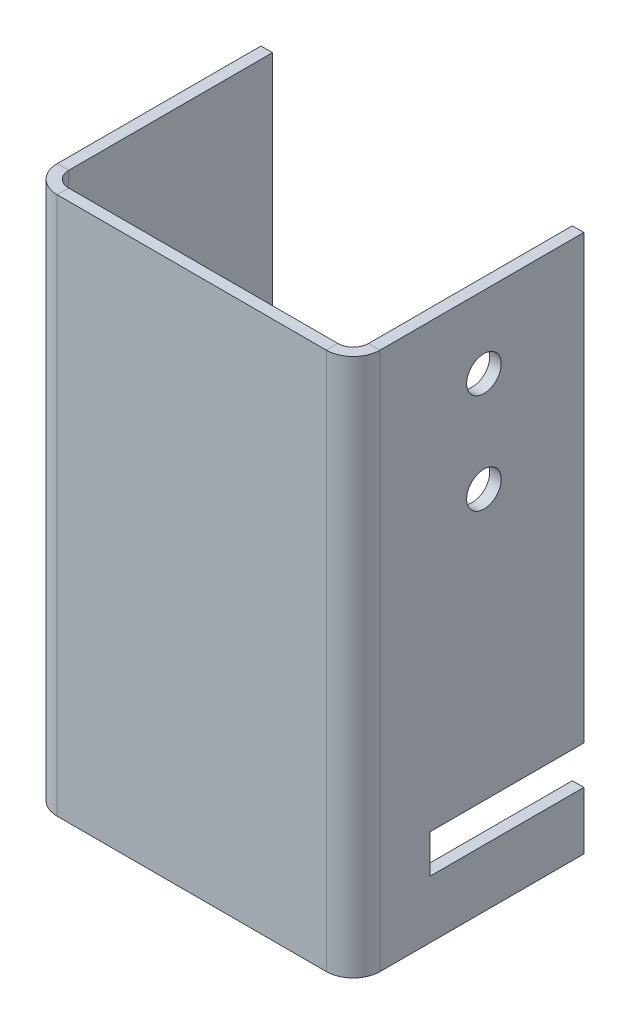
ISO-10303-21;
HEADER;
FILE_DESCRIPTION(('STEP AP214'),'2;1');
FILE_NAME('part.step','',(''),(''),'','','');
FILE_SCHEMA(('AUTOMOTIVE_DESIGN { 1 0 10303 214 1 1 1 1 }'));
ENDSEC;
DATA;
#1=APPLICATION_CONTEXT('core data for automotive mechanical design processes');
#2=APPLICATION_PROTOCOL_DEFINITION('international standard','automotive_design',2000,#1);
#3=PRODUCT_CONTEXT('',#1,'mechanical');
#4=PRODUCT('Part','Part','',(#3));
#5=PRODUCT_RELATED_PRODUCT_CATEGORY('part','',(#4));
#6=PRODUCT_DEFINITION_FORMATION('','',#4);
#7=PRODUCT_DEFINITION_CONTEXT('part definition',#1,'design');
#8=PRODUCT_DEFINITION('design','',#6,#7);
#9=PRODUCT_DEFINITION_SHAPE('','',#8);
#10=(LENGTH_UNIT() NAMED_UNIT(*) SI_UNIT(.MILLI.,.METRE.));
#11=(NAMED_UNIT(*) PLANE_ANGLE_UNIT() SI_UNIT($,.RADIAN.));
#12=(NAMED_UNIT(*) SI_UNIT($,.STERADIAN.) SOLID_ANGLE_UNIT());
#13=UNCERTAINTY_MEASURE_WITH_UNIT(LENGTH_MEASURE(1.E-05),#10,'distance_accuracy_value','');
#14=(GEOMETRIC_REPRESENTATION_CONTEXT(3) GLOBAL_UNCERTAINTY_ASSIGNED_CONTEXT((#13)) GLOBAL_UNIT_ASSIGNED_CONTEXT((#10,
#11,#12)) REPRESENTATION_CONTEXT('',''));
#15=CARTESIAN_POINT('',(0.,0.,0.));
#16=DIRECTION('',(0.,0.,1.));
#17=DIRECTION('',(1.,0.,0.));
#18=AXIS2_PLACEMENT_3D('',#15,#16,#17);
#19=CARTESIAN_POINT('',(42.,70.,-30.));
#20=DIRECTION('',(0.,0.,-1.));
#21=DIRECTION('',(0.,-1.,0.));
#22=AXIS2_PLACEMENT_3D('',#19,#20,#21);
#23=PLANE('',#22);
#24=DIRECTION('',(1.,0.,0.));
#25=VECTOR('',#24,1.);
#26=CARTESIAN_POINT('',(-0.001000000000001,12.5,-30.));
#27=LINE('',#26,#25);
#28=CARTESIAN_POINT('',(40.5,12.5,-30.));
#29=VERTEX_POINT('',#28);
#30=CARTESIAN_POINT('',(42.,12.5,-30.));
#31=VERTEX_POINT('',#30);
#32=EDGE_CURVE('E642',#29,#31,#27,.T.);
#33=ORIENTED_EDGE('',*,*,#32,.F.);
#34=DIRECTION('',(0.,1.,0.));
#35=VECTOR('',#34,1.);
#36=CARTESIAN_POINT('',(40.5,70.,-30.));
#37=LINE('',#36,#35);
#38=CARTESIAN_POINT('',(40.5,70.,-30.));
#39=VERTEX_POINT('',#38);
#40=EDGE_CURVE('E165',#39,#29,#37,.F.);
#41=ORIENTED_EDGE('',*,*,#40,.F.);
#42=DIRECTION('',(1.,0.,0.));
#43=VECTOR('',#42,1.);
#44=CARTESIAN_POINT('',(42.,70.,-30.));
#45=LINE('',#44,#43);
#46=CARTESIAN_POINT('',(42.,70.,-30.));
#47=VERTEX_POINT('',#46);
#48=EDGE_CURVE('E190',#39,#47,#45,.T.);
#49=ORIENTED_EDGE('',*,*,#48,.T.);
#50=DIRECTION('',(0.,-1.,0.));
#51=VECTOR('',#50,1.);
#52=CARTESIAN_POINT('',(42.,70.,-30.));
#53=LINE('',#52,#51);
#54=EDGE_CURVE('E270',#47,#31,#53,.T.);
#55=ORIENTED_EDGE('',*,*,#54,.T.);
#56=EDGE_LOOP('',(#33,#41,#49,#55));
#57=FACE_BOUND('',#56,.T.);
#58=ADVANCED_FACE('F37',(#57),#23,.T.);
#59=CARTESIAN_POINT('',(0.,0.,0.));
#60=DIRECTION('',(0.,1.,0.));
#61=DIRECTION('',(1.,0.,0.));
#62=AXIS2_PLACEMENT_3D('',#59,#60,#61);
#63=PLANE('',#62);
#64=DIRECTION('',(0.,0.,1.));
#65=VECTOR('',#64,1.);
#66=CARTESIAN_POINT('',(3.5,0.,0.));
#67=LINE('',#66,#65);
#68=CARTESIAN_POINT('',(3.5,0.,-1.5));
#69=VERTEX_POINT('',#68);
#70=CARTESIAN_POINT('',(3.5,0.,0.));
#71=VERTEX_POINT('',#70);
#72=EDGE_CURVE('E11',#69,#71,#67,.T.);
#73=ORIENTED_EDGE('',*,*,#72,.F.);
#74=DIRECTION('',(-1.,0.,0.));
#75=VECTOR('',#74,1.);
#76=CARTESIAN_POINT('',(0.,0.,-1.5));
#77=LINE('',#76,#75);
#78=CARTESIAN_POINT('',(38.5,0.,-1.5));
#79=VERTEX_POINT('',#78);
#80=EDGE_CURVE('E151',#69,#79,#77,.F.);
#81=ORIENTED_EDGE('',*,*,#80,.T.);
#82=DIRECTION('',(0.,0.,1.));
#83=VECTOR('',#82,1.);
#84=CARTESIAN_POINT('',(38.5,0.,0.));
#85=LINE('',#84,#83);
#86=CARTESIAN_POINT('',(38.5,0.,0.));
#87=VERTEX_POINT('',#86);
#88=EDGE_CURVE('E46',#79,#87,#85,.T.);
#89=ORIENTED_EDGE('',*,*,#88,.T.);
#90=DIRECTION('',(1.,0.,0.));
#91=VECTOR('',#90,1.);
#92=CARTESIAN_POINT('',(0.,0.,0.));
#93=LINE('',#92,#91);
#94=EDGE_CURVE('E276',#71,#87,#93,.T.);
#95=ORIENTED_EDGE('',*,*,#94,.F.);
#96=EDGE_LOOP('',(#73,#81,#89,#95));
#97=FACE_BOUND('',#96,.T.);
#98=ADVANCED_FACE('F324',(#97),#63,.F.);
#99=CARTESIAN_POINT('',(38.5,0.,-3.5));
#100=DIRECTION('',(0.,1.,0.));
#101=DIRECTION('',(0.,0.,1.));
#102=AXIS2_PLACEMENT_3D('',#99,#100,#101);
#103=PLANE('',#102);
#104=ORIENTED_EDGE('',*,*,#88,.F.);
#105=CARTESIAN_POINT('',(38.5,0.,-3.5));
#106=DIRECTION('',(0.,-1.,0.));
#107=DIRECTION('',(0.,0.,-1.));
#108=AXIS2_PLACEMENT_3D('',#105,#106,#107);
#109=CIRCLE('',#108,2.);
#110=CARTESIAN_POINT('',(40.5,0.,-3.5));
#111=VERTEX_POINT('',#110);
#112=EDGE_CURVE('E161',#79,#111,#109,.F.);
#113=ORIENTED_EDGE('',*,*,#112,.T.);
#114=DIRECTION('',(1.,0.,0.));
#115=VECTOR('',#114,1.);
#116=CARTESIAN_POINT('',(42.,0.,-3.5));
#117=LINE('',#116,#115);
#118=CARTESIAN_POINT('',(42.,0.,-3.5));
#119=VERTEX_POINT('',#118);
#120=EDGE_CURVE('E196',#111,#119,#117,.T.);
#121=ORIENTED_EDGE('',*,*,#120,.T.);
#122=CARTESIAN_POINT('',(38.5,0.,-3.5));
#123=DIRECTION('',(0.,-1.,0.));
#124=DIRECTION('',(0.,0.,-1.));
#125=AXIS2_PLACEMENT_3D('',#122,#123,#124);
#126=CIRCLE('',#125,3.5);
#127=EDGE_CURVE('E204',#87,#119,#126,.F.);
#128=ORIENTED_EDGE('',*,*,#127,.F.);
#129=EDGE_LOOP('',(#104,#113,#121,#128));
#130=FACE_BOUND('',#129,.T.);
#131=ADVANCED_FACE('F203',(#130),#103,.F.);
#132=CARTESIAN_POINT('',(42.,0.,0.));
#133=DIRECTION('',(0.,1.,0.));
#134=DIRECTION('',(0.,0.,-1.));
#135=AXIS2_PLACEMENT_3D('',#132,#133,#134);
#136=PLANE('',#135);
#137=ORIENTED_EDGE('',*,*,#120,.F.);
#138=DIRECTION('',(0.,0.,1.));
#139=VECTOR('',#138,1.);
#140=CARTESIAN_POINT('',(40.5,0.,0.));
#141=LINE('',#140,#139);
#142=CARTESIAN_POINT('',(40.5,0.,-30.));
#143=VERTEX_POINT('',#142);
#144=EDGE_CURVE('E157',#111,#143,#141,.F.);
#145=ORIENTED_EDGE('',*,*,#144,.T.);
#146=DIRECTION('',(1.,0.,0.));
#147=VECTOR('',#146,1.);
#148=CARTESIAN_POINT('',(42.,0.,-30.));
#149=LINE('',#148,#147);
#150=CARTESIAN_POINT('',(42.,0.,-30.));
#151=VERTEX_POINT('',#150);
#152=EDGE_CURVE('E193',#143,#151,#149,.T.);
#153=ORIENTED_EDGE('',*,*,#152,.T.);
#154=DIRECTION('',(0.,0.,-1.));
#155=VECTOR('',#154,1.);
#156=CARTESIAN_POINT('',(42.,0.,0.));
#157=LINE('',#156,#155);
#158=EDGE_CURVE('E223',#119,#151,#157,.T.);
#159=ORIENTED_EDGE('',*,*,#158,.F.);
#160=EDGE_LOOP('',(#137,#145,#153,#159));
#161=FACE_BOUND('',#160,.T.);
#162=ADVANCED_FACE('F224',(#161),#136,.F.);
#163=DIRECTION('',(1.,0.,0.));
#164=VECTOR('',#163,1.);
#165=CARTESIAN_POINT('',(-0.001000000000001,7.5,-30.));
#166=LINE('',#165,#164);
#167=CARTESIAN_POINT('',(40.5,7.50000000000001,-30.));
#168=VERTEX_POINT('',#167);
#169=CARTESIAN_POINT('',(42.,7.5,-30.));
#170=VERTEX_POINT('',#169);
#171=EDGE_CURVE('E53',#168,#170,#166,.T.);
#172=ORIENTED_EDGE('',*,*,#171,.T.);
#173=EDGE_CURVE('E228',#170,#151,#53,.T.);
#174=ORIENTED_EDGE('',*,*,#173,.T.);
#175=ORIENTED_EDGE('',*,*,#152,.F.);
#176=EDGE_CURVE('E168',#168,#143,#37,.F.);
#177=ORIENTED_EDGE('',*,*,#176,.F.);
#178=EDGE_LOOP('',(#172,#174,#175,#177));
#179=FACE_BOUND('',#178,.T.);
#180=ADVANCED_FACE('F265',(#179),#23,.T.);
#181=CARTESIAN_POINT('',(42.,70.,0.));
#182=DIRECTION('',(0.,1.,0.));
#183=DIRECTION('',(0.,0.,-1.));
#184=AXIS2_PLACEMENT_3D('',#181,#182,#183);
#185=PLANE('',#184);
#186=ORIENTED_EDGE('',*,*,#48,.F.);
#187=DIRECTION('',(0.,0.,1.));
#188=VECTOR('',#187,1.);
#189=CARTESIAN_POINT('',(40.5,70.,0.));
#190=LINE('',#189,#188);
#191=CARTESIAN_POINT('',(40.5,70.,-3.5));
#192=VERTEX_POINT('',#191);
#193=EDGE_CURVE('E162',#192,#39,#190,.F.);
#194=ORIENTED_EDGE('',*,*,#193,.F.);
#195=DIRECTION('',(1.,0.,0.));
#196=VECTOR('',#195,1.);
#197=CARTESIAN_POINT('',(42.,70.,-3.5));
#198=LINE('',#197,#196);
#199=CARTESIAN_POINT('',(42.,70.,-3.5));
#200=VERTEX_POINT('',#199);
#201=EDGE_CURVE('E187',#192,#200,#198,.T.);
#202=ORIENTED_EDGE('',*,*,#201,.T.);
#203=DIRECTION('',(0.,0.,-1.));
#204=VECTOR('',#203,1.);
#205=CARTESIAN_POINT('',(42.,70.,0.));
#206=LINE('',#205,#204);
#207=EDGE_CURVE('E236',#200,#47,#206,.T.);
#208=ORIENTED_EDGE('',*,*,#207,.T.);
#209=EDGE_LOOP('',(#186,#194,#202,#208));
#210=FACE_BOUND('',#209,.T.);
#211=ADVANCED_FACE('F315',(#210),#185,.T.);
#212=CARTESIAN_POINT('',(38.5,70.,-3.5));
#213=DIRECTION('',(0.,-1.,0.));
#214=DIRECTION('',(0.,0.,-1.));
#215=AXIS2_PLACEMENT_3D('',#212,#213,#214);
#216=PLANE('',#215);
#217=ORIENTED_EDGE('',*,*,#201,.F.);
#218=CARTESIAN_POINT('',(38.5,70.,-3.5));
#219=DIRECTION('',(0.,-1.,0.));
#220=DIRECTION('',(0.,0.,-1.));
#221=AXIS2_PLACEMENT_3D('',#218,#219,#220);
#222=CIRCLE('',#221,2.);
#223=CARTESIAN_POINT('',(38.5,70.,-1.5));
#224=VERTEX_POINT('',#223);
#225=EDGE_CURVE('E142',#192,#224,#222,.T.);
#226=ORIENTED_EDGE('',*,*,#225,.T.);
#227=DIRECTION('',(0.,0.,1.));
#228=VECTOR('',#227,1.);
#229=CARTESIAN_POINT('',(38.5,70.,0.));
#230=LINE('',#229,#228);
#231=CARTESIAN_POINT('',(38.5,70.,0.));
#232=VERTEX_POINT('',#231);
#233=EDGE_CURVE('E185',#224,#232,#230,.T.);
#234=ORIENTED_EDGE('',*,*,#233,.T.);
#235=CARTESIAN_POINT('',(38.5,70.,-3.5));
#236=DIRECTION('',(0.,1.,0.));
#237=DIRECTION('',(0.,0.,1.));
#238=AXIS2_PLACEMENT_3D('',#235,#236,#237);
#239=CIRCLE('',#238,3.5);
#240=EDGE_CURVE('E219',#200,#232,#239,.F.);
#241=ORIENTED_EDGE('',*,*,#240,.F.);
#242=EDGE_LOOP('',(#217,#226,#234,#241));
#243=FACE_BOUND('',#242,.T.);
#244=ADVANCED_FACE('F317',(#243),#216,.F.);
#245=CARTESIAN_POINT('',(0.,70.,0.));
#246=DIRECTION('',(0.,1.,0.));
#247=DIRECTION('',(1.,0.,0.));
#248=AXIS2_PLACEMENT_3D('',#245,#246,#247);
#249=PLANE('',#248);
#250=ORIENTED_EDGE('',*,*,#233,.F.);
#251=DIRECTION('',(-1.,0.,0.));
#252=VECTOR('',#251,1.);
#253=CARTESIAN_POINT('',(0.,70.,-1.5));
#254=LINE('',#253,#252);
#255=CARTESIAN_POINT('',(3.5,70.,-1.5));
#256=VERTEX_POINT('',#255);
#257=EDGE_CURVE('E146',#256,#224,#254,.F.);
#258=ORIENTED_EDGE('',*,*,#257,.F.);
#259=DIRECTION('',(0.,0.,1.));
#260=VECTOR('',#259,1.);
#261=CARTESIAN_POINT('',(3.5,70.,0.));
#262=LINE('',#261,#260);
#263=CARTESIAN_POINT('',(3.5,70.,0.));
#264=VERTEX_POINT('',#263);
#265=EDGE_CURVE('E182',#256,#264,#262,.T.);
#266=ORIENTED_EDGE('',*,*,#265,.T.);
#267=DIRECTION('',(1.,0.,0.));
#268=VECTOR('',#267,1.);
#269=CARTESIAN_POINT('',(0.,70.,0.));
#270=LINE('',#269,#268);
#271=EDGE_CURVE('E278',#264,#232,#270,.T.);
#272=ORIENTED_EDGE('',*,*,#271,.T.);
#273=EDGE_LOOP('',(#250,#258,#266,#272));
#274=FACE_BOUND('',#273,.T.);
#275=ADVANCED_FACE('F320',(#274),#249,.T.);
#276=CARTESIAN_POINT('',(3.5,70.,-3.5));
#277=DIRECTION('',(0.,-1.,0.));
#278=DIRECTION('',(0.,0.,-1.));
#279=AXIS2_PLACEMENT_3D('',#276,#277,#278);
#280=PLANE('',#279);
#281=ORIENTED_EDGE('',*,*,#265,.F.);
#282=CARTESIAN_POINT('',(3.5,70.,-3.5));
#283=DIRECTION('',(0.,-1.,0.));
#284=DIRECTION('',(0.,0.,-1.));
#285=AXIS2_PLACEMENT_3D('',#282,#283,#284);
#286=CIRCLE('',#285,2.);
#287=CARTESIAN_POINT('',(1.5,70.,-3.5));
#288=VERTEX_POINT('',#287);
#289=EDGE_CURVE('E141',#256,#288,#286,.T.);
#290=ORIENTED_EDGE('',*,*,#289,.T.);
#291=DIRECTION('',(-1.,0.,0.));
#292=VECTOR('',#291,1.);
#293=CARTESIAN_POINT('',(0.,70.,-3.5));
#294=LINE('',#293,#292);
#295=CARTESIAN_POINT('',(0.,70.,-3.5));
#296=VERTEX_POINT('',#295);
#297=EDGE_CURVE('E179',#288,#296,#294,.T.);
#298=ORIENTED_EDGE('',*,*,#297,.T.);
#299=CARTESIAN_POINT('',(3.5,70.,-3.5));
#300=DIRECTION('',(0.,1.,0.));
#301=DIRECTION('',(0.,0.,1.));
#302=AXIS2_PLACEMENT_3D('',#299,#300,#301);
#303=CIRCLE('',#302,3.5);
#304=EDGE_CURVE('E229',#264,#296,#303,.F.);
#305=ORIENTED_EDGE('',*,*,#304,.F.);
#306=EDGE_LOOP('',(#281,#290,#298,#305));
#307=FACE_BOUND('',#306,.T.);
#308=ADVANCED_FACE('F327',(#307),#280,.F.);
#309=CARTESIAN_POINT('',(0.,70.,0.));
#310=DIRECTION('',(0.,1.,0.));
#311=DIRECTION('',(0.,0.,1.));
#312=AXIS2_PLACEMENT_3D('',#309,#310,#311);
#313=PLANE('',#312);
#314=ORIENTED_EDGE('',*,*,#297,.F.);
#315=DIRECTION('',(0.,0.,-1.));
#316=VECTOR('',#315,1.);
#317=CARTESIAN_POINT('',(1.5,70.,0.));
#318=LINE('',#317,#316);
#319=CARTESIAN_POINT('',(1.5,70.,-30.));
#320=VERTEX_POINT('',#319);
#321=EDGE_CURVE('E130',#320,#288,#318,.F.);
#322=ORIENTED_EDGE('',*,*,#321,.F.);
#323=DIRECTION('',(-1.,0.,0.));
#324=VECTOR('',#323,1.);
#325=CARTESIAN_POINT('',(0.,70.,-30.));
#326=LINE('',#325,#324);
#327=CARTESIAN_POINT('',(0.,70.,-30.));
#328=VERTEX_POINT('',#327);
#329=EDGE_CURVE('E176',#320,#328,#326,.T.);
#330=ORIENTED_EDGE('',*,*,#329,.T.);
#331=DIRECTION('',(0.,0.,1.));
#332=VECTOR('',#331,1.);
#333=CARTESIAN_POINT('',(0.,70.,0.));
#334=LINE('',#333,#332);
#335=EDGE_CURVE('E283',#328,#296,#334,.T.);
#336=ORIENTED_EDGE('',*,*,#335,.T.);
#337=EDGE_LOOP('',(#314,#322,#330,#336));
#338=FACE_BOUND('',#337,.T.);
#339=ADVANCED_FACE('F301',(#338),#313,.T.);
#340=CARTESIAN_POINT('',(0.,70.,-30.));
#341=DIRECTION('',(0.,0.,1.));
#342=DIRECTION('',(0.,-1.,0.));
#343=AXIS2_PLACEMENT_3D('',#340,#341,#342);
#344=PLANE('',#343);
#345=ORIENTED_EDGE('',*,*,#329,.F.);
#346=DIRECTION('',(0.,1.,0.));
#347=VECTOR('',#346,1.);
#348=CARTESIAN_POINT('',(1.5,70.,-30.));
#349=LINE('',#348,#347);
#350=CARTESIAN_POINT('',(1.5,0.,-30.));
#351=VERTEX_POINT('',#350);
#352=EDGE_CURVE('E148',#320,#351,#349,.F.);
#353=ORIENTED_EDGE('',*,*,#352,.T.);
#354=DIRECTION('',(-1.,0.,0.));
#355=VECTOR('',#354,1.);
#356=CARTESIAN_POINT('',(0.,0.,-30.));
#357=LINE('',#356,#355);
#358=CARTESIAN_POINT('',(0.,0.,-30.));
#359=VERTEX_POINT('',#358);
#360=EDGE_CURVE('E118',#351,#359,#357,.T.);
#361=ORIENTED_EDGE('',*,*,#360,.T.);
#362=DIRECTION('',(0.,-1.,0.));
#363=VECTOR('',#362,1.);
#364=CARTESIAN_POINT('',(0.,70.,-30.));
#365=LINE('',#364,#363);
#366=EDGE_CURVE('E286',#328,#359,#365,.T.);
#367=ORIENTED_EDGE('',*,*,#366,.F.);
#368=EDGE_LOOP('',(#345,#353,#361,#367));
#369=FACE_BOUND('',#368,.T.);
#370=ADVANCED_FACE('F334',(#369),#344,.F.);
#371=CARTESIAN_POINT('',(0.,0.,0.));
#372=DIRECTION('',(0.,1.,0.));
#373=DIRECTION('',(0.,0.,1.));
#374=AXIS2_PLACEMENT_3D('',#371,#372,#373);
#375=PLANE('',#374);
#376=ORIENTED_EDGE('',*,*,#360,.F.);
#377=DIRECTION('',(0.,0.,-1.));
#378=VECTOR('',#377,1.);
#379=CARTESIAN_POINT('',(1.5,0.,0.));
#380=LINE('',#379,#378);
#381=CARTESIAN_POINT('',(1.5,0.,-3.5));
#382=VERTEX_POINT('',#381);
#383=EDGE_CURVE('E127',#351,#382,#380,.F.);
#384=ORIENTED_EDGE('',*,*,#383,.T.);
#385=DIRECTION('',(-1.,0.,0.));
#386=VECTOR('',#385,1.);
#387=CARTESIAN_POINT('',(0.,0.,-3.5));
#388=LINE('',#387,#386);
#389=CARTESIAN_POINT('',(0.,0.,-3.5));
#390=VERTEX_POINT('',#389);
#391=EDGE_CURVE('E41',#382,#390,#388,.T.);
#392=ORIENTED_EDGE('',*,*,#391,.T.);
#393=DIRECTION('',(0.,0.,1.));
#394=VECTOR('',#393,1.);
#395=CARTESIAN_POINT('',(0.,0.,0.));
#396=LINE('',#395,#394);
#397=EDGE_CURVE('E281',#359,#390,#396,.T.);
#398=ORIENTED_EDGE('',*,*,#397,.F.);
#399=EDGE_LOOP('',(#376,#384,#392,#398));
#400=FACE_BOUND('',#399,.T.);
#401=ADVANCED_FACE('F144',(#400),#375,.F.);
#402=CARTESIAN_POINT('',(3.5,0.,-3.5));
#403=DIRECTION('',(0.,1.,0.));
#404=DIRECTION('',(0.,0.,1.));
#405=AXIS2_PLACEMENT_3D('',#402,#403,#404);
#406=PLANE('',#405);
#407=CARTESIAN_POINT('',(3.5,0.,-3.5));
#408=DIRECTION('',(0.,-1.,0.));
#409=DIRECTION('',(0.,0.,-1.));
#410=AXIS2_PLACEMENT_3D('',#407,#408,#409);
#411=CIRCLE('',#410,2.);
#412=EDGE_CURVE('E109',#382,#69,#411,.F.);
#413=ORIENTED_EDGE('',*,*,#412,.T.);
#414=ORIENTED_EDGE('',*,*,#72,.T.);
#415=CARTESIAN_POINT('',(3.5,0.,-3.5));
#416=DIRECTION('',(0.,-1.,0.));
#417=DIRECTION('',(0.,0.,-1.));
#418=AXIS2_PLACEMENT_3D('',#415,#416,#417);
#419=CIRCLE('',#418,3.5);
#420=EDGE_CURVE('E112',#390,#71,#419,.F.);
#421=ORIENTED_EDGE('',*,*,#420,.F.);
#422=ORIENTED_EDGE('',*,*,#391,.F.);
#423=EDGE_LOOP('',(#413,#414,#421,#422));
#424=FACE_BOUND('',#423,.T.);
#425=ADVANCED_FACE('F39',(#424),#406,.F.);
#426=CARTESIAN_POINT('',(0.,70.,0.));
#427=DIRECTION('',(1.,0.,0.));
#428=DIRECTION('',(0.,0.,-1.));
#429=AXIS2_PLACEMENT_3D('',#426,#427,#428);
#430=PLANE('',#429);
#431=ORIENTED_EDGE('',*,*,#397,.T.);
#432=DIRECTION('',(0.,-1.,0.));
#433=VECTOR('',#432,1.);
#434=CARTESIAN_POINT('',(0.,70.,-3.5));
#435=LINE('',#434,#433);
#436=EDGE_CURVE('E238',#390,#296,#435,.F.);
#437=ORIENTED_EDGE('',*,*,#436,.T.);
#438=ORIENTED_EDGE('',*,*,#335,.F.);
#439=ORIENTED_EDGE('',*,*,#366,.T.);
#440=EDGE_LOOP('',(#431,#437,#438,#439));
#441=FACE_BOUND('',#440,.T.);
#442=ADVANCED_FACE('F305',(#441),#430,.F.);
#443=CARTESIAN_POINT('',(0.,70.,0.));
#444=DIRECTION('',(0.,0.,-1.));
#445=DIRECTION('',(-1.,0.,0.));
#446=AXIS2_PLACEMENT_3D('',#443,#444,#445);
#447=PLANE('',#446);
#448=ORIENTED_EDGE('',*,*,#94,.T.);
#449=DIRECTION('',(0.,-1.,0.));
#450=VECTOR('',#449,1.);
#451=CARTESIAN_POINT('',(38.5,70.,0.));
#452=LINE('',#451,#450);
#453=EDGE_CURVE('E119',#87,#232,#452,.F.);
#454=ORIENTED_EDGE('',*,*,#453,.T.);
#455=ORIENTED_EDGE('',*,*,#271,.F.);
#456=DIRECTION('',(0.,-1.,0.));
#457=VECTOR('',#456,1.);
#458=CARTESIAN_POINT('',(3.5,70.,0.));
#459=LINE('',#458,#457);
#460=EDGE_CURVE('E242',#264,#71,#459,.T.);
#461=ORIENTED_EDGE('',*,*,#460,.T.);
#462=EDGE_LOOP('',(#448,#454,#455,#461));
#463=FACE_BOUND('',#462,.T.);
#464=ADVANCED_FACE('F323',(#463),#447,.F.);
#465=CARTESIAN_POINT('',(42.,70.,0.));
#466=DIRECTION('',(-1.,0.,0.));
#467=DIRECTION('',(0.,0.,1.));
#468=AXIS2_PLACEMENT_3D('',#465,#466,#467);
#469=PLANE('',#468);
#470=CARTESIAN_POINT('',(42.,60.6,-17.));
#471=DIRECTION('',(1.,0.,0.));
#472=DIRECTION('',(0.,0.,-1.));
#473=AXIS2_PLACEMENT_3D('',#470,#471,#472);
#474=CIRCLE('',#473,2.25);
#475=CARTESIAN_POINT('',(42.,60.6,-19.25));
#476=VERTEX_POINT('',#475);
#477=EDGE_CURVE('E173',#476,#476,#474,.T.);
#478=ORIENTED_EDGE('',*,*,#477,.F.);
#479=EDGE_LOOP('',(#478));
#480=FACE_BOUND('',#479,.T.);
#481=CARTESIAN_POINT('',(42.,47.6,-17.));
#482=DIRECTION('',(1.,0.,0.));
#483=DIRECTION('',(0.,0.,-1.));
#484=AXIS2_PLACEMENT_3D('',#481,#482,#483);
#485=CIRCLE('',#484,2.25);
#486=CARTESIAN_POINT('',(42.,47.6,-19.25));
#487=VERTEX_POINT('',#486);
#488=EDGE_CURVE('E658',#487,#487,#485,.T.);
#489=ORIENTED_EDGE('',*,*,#488,.F.);
#490=EDGE_LOOP('',(#489));
#491=FACE_BOUND('',#490,.T.);
#492=DIRECTION('',(0.,-1.,0.));
#493=VECTOR('',#492,1.);
#494=CARTESIAN_POINT('',(42.,12.5,-10.));
#495=LINE('',#494,#493);
#496=CARTESIAN_POINT('',(42.,12.5,-10.));
#497=VERTEX_POINT('',#496);
#498=CARTESIAN_POINT('',(42.,7.5,-10.));
#499=VERTEX_POINT('',#498);
#500=EDGE_CURVE('E636',#497,#499,#495,.T.);
#501=ORIENTED_EDGE('',*,*,#500,.F.);
#502=DIRECTION('',(0.,0.,1.));
#503=VECTOR('',#502,1.);
#504=CARTESIAN_POINT('',(42.,12.5,-30.));
#505=LINE('',#504,#503);
#506=EDGE_CURVE('E640',#31,#497,#505,.T.);
#507=ORIENTED_EDGE('',*,*,#506,.F.);
#508=ORIENTED_EDGE('',*,*,#54,.F.);
#509=ORIENTED_EDGE('',*,*,#207,.F.);
#510=DIRECTION('',(0.,-1.,0.));
#511=VECTOR('',#510,1.);
#512=CARTESIAN_POINT('',(42.,70.,-3.5));
#513=LINE('',#512,#511);
#514=EDGE_CURVE('E217',#200,#119,#513,.T.);
#515=ORIENTED_EDGE('',*,*,#514,.T.);
#516=ORIENTED_EDGE('',*,*,#158,.T.);
#517=ORIENTED_EDGE('',*,*,#173,.F.);
#518=DIRECTION('',(0.,0.,-1.));
#519=VECTOR('',#518,1.);
#520=CARTESIAN_POINT('',(42.,7.5,-30.));
#521=LINE('',#520,#519);
#522=EDGE_CURVE('E628',#499,#170,#521,.T.);
#523=ORIENTED_EDGE('',*,*,#522,.F.);
#524=EDGE_LOOP('',(#501,#507,#508,#509,#515,#516,#517,#523));
#525=FACE_BOUND('',#524,.T.);
#526=ADVANCED_FACE('F233',(#480,#491,#525),#469,.F.);
#527=CARTESIAN_POINT('',(3.5,70.,-3.5));
#528=DIRECTION('',(0.,-1.,0.));
#529=DIRECTION('',(0.,0.,-1.));
#530=AXIS2_PLACEMENT_3D('',#527,#528,#529);
#531=CYLINDRICAL_SURFACE('',#530,3.5);
#532=ORIENTED_EDGE('',*,*,#304,.T.);
#533=ORIENTED_EDGE('',*,*,#436,.F.);
#534=ORIENTED_EDGE('',*,*,#420,.T.);
#535=ORIENTED_EDGE('',*,*,#460,.F.);
#536=EDGE_LOOP('',(#532,#533,#534,#535));
#537=FACE_BOUND('',#536,.T.);
#538=ADVANCED_FACE('F295',(#537),#531,.T.);
#539=CARTESIAN_POINT('',(38.5,70.,-3.5));
#540=DIRECTION('',(0.,-1.,0.));
#541=DIRECTION('',(0.,0.,-1.));
#542=AXIS2_PLACEMENT_3D('',#539,#540,#541);
#543=CYLINDRICAL_SURFACE('',#542,3.5);
#544=ORIENTED_EDGE('',*,*,#240,.T.);
#545=ORIENTED_EDGE('',*,*,#453,.F.);
#546=ORIENTED_EDGE('',*,*,#127,.T.);
#547=ORIENTED_EDGE('',*,*,#514,.F.);
#548=EDGE_LOOP('',(#544,#545,#546,#547));
#549=FACE_BOUND('',#548,.T.);
#550=ADVANCED_FACE('F215',(#549),#543,.T.);
#551=CARTESIAN_POINT('',(1.5,70.,0.));
#552=DIRECTION('',(1.,0.,0.));
#553=DIRECTION('',(0.,0.,-1.));
#554=AXIS2_PLACEMENT_3D('',#551,#552,#553);
#555=PLANE('',#554);
#556=ORIENTED_EDGE('',*,*,#383,.F.);
#557=ORIENTED_EDGE('',*,*,#352,.F.);
#558=ORIENTED_EDGE('',*,*,#321,.T.);
#559=DIRECTION('',(0.,1.,0.));
#560=VECTOR('',#559,1.);
#561=CARTESIAN_POINT('',(1.5,70.,-3.5));
#562=LINE('',#561,#560);
#563=EDGE_CURVE('E124',#382,#288,#562,.T.);
#564=ORIENTED_EDGE('',*,*,#563,.F.);
#565=EDGE_LOOP('',(#556,#557,#558,#564));
#566=FACE_BOUND('',#565,.T.);
#567=ADVANCED_FACE('F125',(#566),#555,.T.);
#568=CARTESIAN_POINT('',(0.,70.,-1.5));
#569=DIRECTION('',(0.,0.,-1.));
#570=DIRECTION('',(-1.,0.,0.));
#571=AXIS2_PLACEMENT_3D('',#568,#569,#570);
#572=PLANE('',#571);
#573=ORIENTED_EDGE('',*,*,#80,.F.);
#574=DIRECTION('',(0.,1.,0.));
#575=VECTOR('',#574,1.);
#576=CARTESIAN_POINT('',(3.5,70.,-1.5));
#577=LINE('',#576,#575);
#578=EDGE_CURVE('E135',#256,#69,#577,.F.);
#579=ORIENTED_EDGE('',*,*,#578,.F.);
#580=ORIENTED_EDGE('',*,*,#257,.T.);
#581=DIRECTION('',(0.,1.,0.));
#582=VECTOR('',#581,1.);
#583=CARTESIAN_POINT('',(38.5,70.,-1.5));
#584=LINE('',#583,#582);
#585=EDGE_CURVE('E220',#79,#224,#584,.T.);
#586=ORIENTED_EDGE('',*,*,#585,.F.);
#587=EDGE_LOOP('',(#573,#579,#580,#586));
#588=FACE_BOUND('',#587,.T.);
#589=ADVANCED_FACE('F326',(#588),#572,.T.);
#590=CARTESIAN_POINT('',(40.5,70.,0.));
#591=DIRECTION('',(-1.,0.,0.));
#592=DIRECTION('',(0.,0.,1.));
#593=AXIS2_PLACEMENT_3D('',#590,#591,#592);
#594=PLANE('',#593);
#595=DIRECTION('',(0.,0.,1.));
#596=VECTOR('',#595,1.);
#597=CARTESIAN_POINT('',(40.5,12.5,-30.));
#598=LINE('',#597,#596);
#599=CARTESIAN_POINT('',(40.5,12.5,-10.));
#600=VERTEX_POINT('',#599);
#601=EDGE_CURVE('E648',#29,#600,#598,.T.);
#602=ORIENTED_EDGE('',*,*,#601,.T.);
#603=DIRECTION('',(0.,-1.,0.));
#604=VECTOR('',#603,1.);
#605=CARTESIAN_POINT('',(40.5,12.5,-10.));
#606=LINE('',#605,#604);
#607=CARTESIAN_POINT('',(40.5,7.5,-10.));
#608=VERTEX_POINT('',#607);
#609=EDGE_CURVE('E670',#600,#608,#606,.T.);
#610=ORIENTED_EDGE('',*,*,#609,.T.);
#611=DIRECTION('',(0.,0.,-1.));
#612=VECTOR('',#611,1.);
#613=CARTESIAN_POINT('',(40.5,7.5,-30.));
#614=LINE('',#613,#612);
#615=EDGE_CURVE('E262',#608,#168,#614,.T.);
#616=ORIENTED_EDGE('',*,*,#615,.T.);
#617=ORIENTED_EDGE('',*,*,#176,.T.);
#618=ORIENTED_EDGE('',*,*,#144,.F.);
#619=DIRECTION('',(0.,1.,0.));
#620=VECTOR('',#619,1.);
#621=CARTESIAN_POINT('',(40.5,70.,-3.5));
#622=LINE('',#621,#620);
#623=EDGE_CURVE('E134',#192,#111,#622,.F.);
#624=ORIENTED_EDGE('',*,*,#623,.F.);
#625=ORIENTED_EDGE('',*,*,#193,.T.);
#626=ORIENTED_EDGE('',*,*,#40,.T.);
#627=EDGE_LOOP('',(#602,#610,#616,#617,#618,#624,#625,#626));
#628=FACE_BOUND('',#627,.T.);
#629=CARTESIAN_POINT('',(40.5,60.6,-17.));
#630=DIRECTION('',(-1.,0.,0.));
#631=DIRECTION('',(0.,0.,1.));
#632=AXIS2_PLACEMENT_3D('',#629,#630,#631);
#633=CIRCLE('',#632,2.25);
#634=CARTESIAN_POINT('',(40.5,60.6,-14.75));
#635=VERTEX_POINT('',#634);
#636=EDGE_CURVE('E655',#635,#635,#633,.F.);
#637=ORIENTED_EDGE('',*,*,#636,.T.);
#638=EDGE_LOOP('',(#637));
#639=FACE_BOUND('',#638,.T.);
#640=CARTESIAN_POINT('',(40.5,47.6,-17.));
#641=DIRECTION('',(-1.,0.,0.));
#642=DIRECTION('',(0.,0.,1.));
#643=AXIS2_PLACEMENT_3D('',#640,#641,#642);
#644=CIRCLE('',#643,2.25);
#645=CARTESIAN_POINT('',(40.5,47.6,-14.75));
#646=VERTEX_POINT('',#645);
#647=EDGE_CURVE('E652',#646,#646,#644,.F.);
#648=ORIENTED_EDGE('',*,*,#647,.T.);
#649=EDGE_LOOP('',(#648));
#650=FACE_BOUND('',#649,.T.);
#651=ADVANCED_FACE('F258',(#628,#639,#650),#594,.T.);
#652=CARTESIAN_POINT('',(3.5,70.,-3.5));
#653=DIRECTION('',(0.,-1.,0.));
#654=DIRECTION('',(0.,0.,-1.));
#655=AXIS2_PLACEMENT_3D('',#652,#653,#654);
#656=CYLINDRICAL_SURFACE('',#655,2.);
#657=ORIENTED_EDGE('',*,*,#289,.F.);
#658=ORIENTED_EDGE('',*,*,#578,.T.);
#659=ORIENTED_EDGE('',*,*,#412,.F.);
#660=ORIENTED_EDGE('',*,*,#563,.T.);
#661=EDGE_LOOP('',(#657,#658,#659,#660));
#662=FACE_BOUND('',#661,.T.);
#663=ADVANCED_FACE('F138',(#662),#656,.F.);
#664=CARTESIAN_POINT('',(38.5,70.,-3.5));
#665=DIRECTION('',(0.,-1.,0.));
#666=DIRECTION('',(0.,0.,-1.));
#667=AXIS2_PLACEMENT_3D('',#664,#665,#666);
#668=CYLINDRICAL_SURFACE('',#667,2.);
#669=ORIENTED_EDGE('',*,*,#225,.F.);
#670=ORIENTED_EDGE('',*,*,#623,.T.);
#671=ORIENTED_EDGE('',*,*,#112,.F.);
#672=ORIENTED_EDGE('',*,*,#585,.T.);
#673=EDGE_LOOP('',(#669,#670,#671,#672));
#674=FACE_BOUND('',#673,.T.);
#675=ADVANCED_FACE('F254',(#674),#668,.F.);
#676=CARTESIAN_POINT('',(-0.001000000000001,47.6,-17.));
#677=DIRECTION('',(1.,0.,0.));
#678=DIRECTION('',(0.,0.,-1.));
#679=AXIS2_PLACEMENT_3D('',#676,#677,#678);
#680=CYLINDRICAL_SURFACE('',#679,2.25);
#681=ORIENTED_EDGE('',*,*,#647,.F.);
#682=EDGE_LOOP('',(#681));
#683=FACE_BOUND('',#682,.T.);
#684=ORIENTED_EDGE('',*,*,#488,.T.);
#685=EDGE_LOOP('',(#684));
#686=FACE_BOUND('',#685,.T.);
#687=ADVANCED_FACE('F552',(#683,#686),#680,.F.);
#688=CARTESIAN_POINT('',(-0.001000000000001,60.6,-17.));
#689=DIRECTION('',(1.,0.,0.));
#690=DIRECTION('',(0.,0.,-1.));
#691=AXIS2_PLACEMENT_3D('',#688,#689,#690);
#692=CYLINDRICAL_SURFACE('',#691,2.25);
#693=ORIENTED_EDGE('',*,*,#636,.F.);
#694=EDGE_LOOP('',(#693));
#695=FACE_BOUND('',#694,.T.);
#696=ORIENTED_EDGE('',*,*,#477,.T.);
#697=EDGE_LOOP('',(#696));
#698=FACE_BOUND('',#697,.T.);
#699=ADVANCED_FACE('F561',(#695,#698),#692,.F.);
#700=CARTESIAN_POINT('',(-0.001000000000001,12.5,-30.));
#701=DIRECTION('',(0.,1.,0.));
#702=DIRECTION('',(0.,0.,1.));
#703=AXIS2_PLACEMENT_3D('',#700,#701,#702);
#704=PLANE('',#703);
#705=ORIENTED_EDGE('',*,*,#32,.T.);
#706=ORIENTED_EDGE('',*,*,#506,.T.);
#707=DIRECTION('',(1.,0.,0.));
#708=VECTOR('',#707,1.);
#709=CARTESIAN_POINT('',(-0.001000000000001,12.5,-10.));
#710=LINE('',#709,#708);
#711=EDGE_CURVE('E633',#600,#497,#710,.T.);
#712=ORIENTED_EDGE('',*,*,#711,.F.);
#713=ORIENTED_EDGE('',*,*,#601,.F.);
#714=EDGE_LOOP('',(#705,#706,#712,#713));
#715=FACE_BOUND('',#714,.T.);
#716=ADVANCED_FACE('F570',(#715),#704,.F.);
#717=CARTESIAN_POINT('',(-0.001000000000001,12.5,-10.));
#718=DIRECTION('',(0.,0.,1.));
#719=DIRECTION('',(1.,0.,0.));
#720=AXIS2_PLACEMENT_3D('',#717,#718,#719);
#721=PLANE('',#720);
#722=ORIENTED_EDGE('',*,*,#711,.T.);
#723=ORIENTED_EDGE('',*,*,#500,.T.);
#724=DIRECTION('',(1.,0.,0.));
#725=VECTOR('',#724,1.);
#726=CARTESIAN_POINT('',(-0.001000000000001,7.5,-10.));
#727=LINE('',#726,#725);
#728=EDGE_CURVE('E626',#608,#499,#727,.T.);
#729=ORIENTED_EDGE('',*,*,#728,.F.);
#730=ORIENTED_EDGE('',*,*,#609,.F.);
#731=EDGE_LOOP('',(#722,#723,#729,#730));
#732=FACE_BOUND('',#731,.T.);
#733=ADVANCED_FACE('F585',(#732),#721,.F.);
#734=CARTESIAN_POINT('',(-0.001000000000001,7.5,-30.));
#735=DIRECTION('',(0.,-1.,0.));
#736=DIRECTION('',(0.,0.,-1.));
#737=AXIS2_PLACEMENT_3D('',#734,#735,#736);
#738=PLANE('',#737);
#739=ORIENTED_EDGE('',*,*,#728,.T.);
#740=ORIENTED_EDGE('',*,*,#522,.T.);
#741=ORIENTED_EDGE('',*,*,#171,.F.);
#742=ORIENTED_EDGE('',*,*,#615,.F.);
#743=EDGE_LOOP('',(#739,#740,#741,#742));
#744=FACE_BOUND('',#743,.T.);
#745=ADVANCED_FACE('F594',(#744),#738,.F.);
#746=CLOSED_SHELL('',(#58,#98,#131,#162,#180,#211,#244,#275,#308,#339,#370,#401,#425,#442,#464,
#526,#538,#550,#567,#589,#651,#663,#675,#687,#699,#716,#733,#745));
#747=MANIFOLD_SOLID_BREP('B2',#746);
#748=ADVANCED_BREP_SHAPE_REPRESENTATION('',(#18,#747),#14);
#749=SHAPE_DEFINITION_REPRESENTATION(#9,#748);
ENDSEC;
END-ISO-10303-21;
